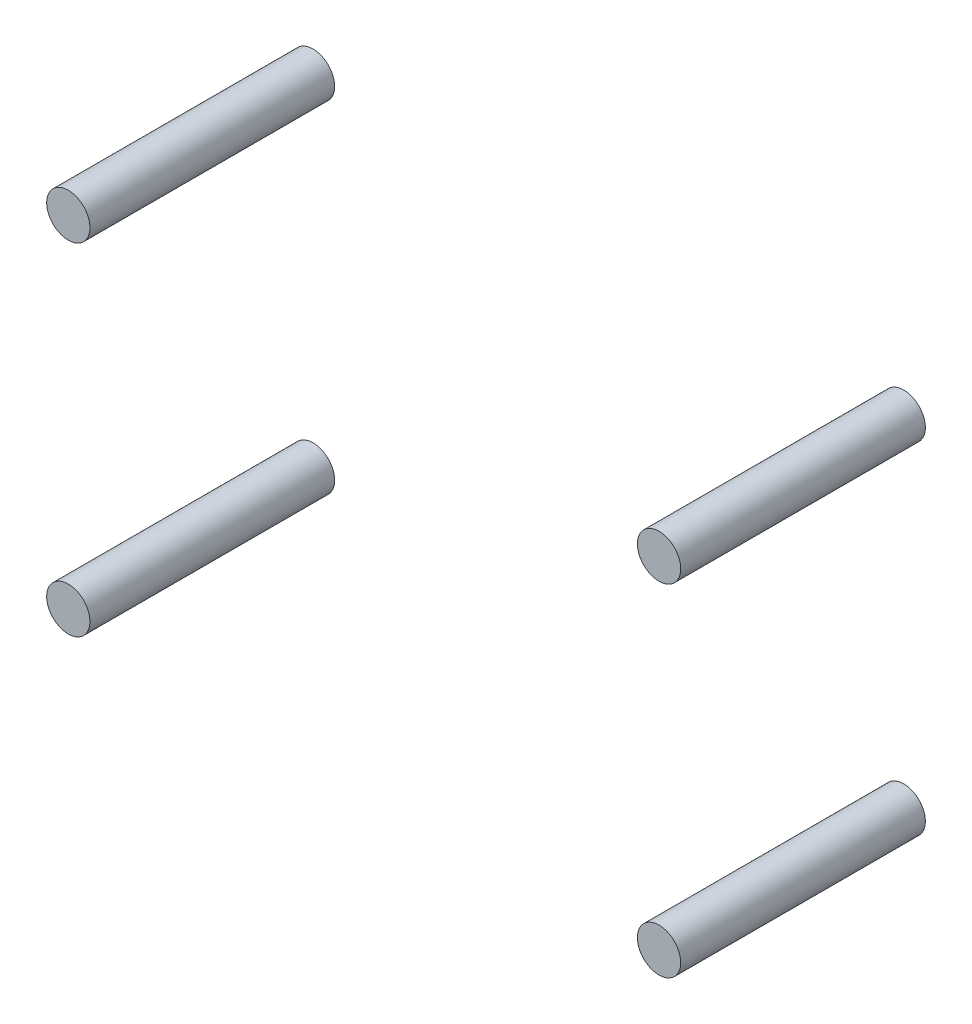
ISO-10303-21;
HEADER;
FILE_DESCRIPTION(('STEP AP214'),'2;1');
FILE_NAME('part.step','',(''),(''),'','','');
FILE_SCHEMA(('AUTOMOTIVE_DESIGN { 1 0 10303 214 1 1 1 1 }'));
ENDSEC;
DATA;
#1=APPLICATION_CONTEXT('core data for automotive mechanical design processes');
#2=APPLICATION_PROTOCOL_DEFINITION('international standard','automotive_design',2000,#1);
#3=PRODUCT_CONTEXT('',#1,'mechanical');
#4=PRODUCT('Part','Part','',(#3));
#5=PRODUCT_RELATED_PRODUCT_CATEGORY('part','',(#4));
#6=PRODUCT_DEFINITION_FORMATION('','',#4);
#7=PRODUCT_DEFINITION_CONTEXT('part definition',#1,'design');
#8=PRODUCT_DEFINITION('design','',#6,#7);
#9=PRODUCT_DEFINITION_SHAPE('','',#8);
#10=(LENGTH_UNIT() NAMED_UNIT(*) SI_UNIT(.MILLI.,.METRE.));
#11=(NAMED_UNIT(*) PLANE_ANGLE_UNIT() SI_UNIT($,.RADIAN.));
#12=(NAMED_UNIT(*) SI_UNIT($,.STERADIAN.) SOLID_ANGLE_UNIT());
#13=UNCERTAINTY_MEASURE_WITH_UNIT(LENGTH_MEASURE(1.E-05),#10,'distance_accuracy_value','');
#14=(GEOMETRIC_REPRESENTATION_CONTEXT(3) GLOBAL_UNCERTAINTY_ASSIGNED_CONTEXT((#13)) GLOBAL_UNIT_ASSIGNED_CONTEXT((#10,
#11,#12)) REPRESENTATION_CONTEXT('',''));
#15=CARTESIAN_POINT('',(0.,0.,0.));
#16=DIRECTION('',(0.,0.,1.));
#17=DIRECTION('',(1.,0.,0.));
#18=AXIS2_PLACEMENT_3D('',#15,#16,#17);
#19=CARTESIAN_POINT('',(15.2256,-9.232966316019,-8.5));
#20=DIRECTION('',(0.,0.,-1.));
#21=DIRECTION('',(-1.,0.,0.));
#22=AXIS2_PLACEMENT_3D('',#19,#20,#21);
#23=PLANE('',#22);
#24=CARTESIAN_POINT('',(13.64,7.875,-8.49999999999964));
#25=DIRECTION('',(0.,0.,-1.));
#26=DIRECTION('',(-1.,0.,0.));
#27=AXIS2_PLACEMENT_3D('',#24,#25,#26);
#28=CIRCLE('',#27,1.);
#29=CARTESIAN_POINT('',(12.64,7.875,-8.49999999999964));
#30=VERTEX_POINT('',#29);
#31=EDGE_CURVE('P0_E19',#30,#30,#28,.T.);
#32=ORIENTED_EDGE('',*,*,#31,.T.);
#33=EDGE_LOOP('',(#32));
#34=FACE_BOUND('',#33,.T.);
#35=ADVANCED_FACE('P0_F15',(#34),#23,.T.);
#36=CARTESIAN_POINT('',(13.64,7.875,2.79999999999999));
#37=DIRECTION('',(0.,0.,-1.));
#38=DIRECTION('',(-1.,0.,0.));
#39=AXIS2_PLACEMENT_3D('',#36,#37,#38);
#40=CYLINDRICAL_SURFACE('',#39,1.);
#41=ORIENTED_EDGE('',*,*,#31,.F.);
#42=EDGE_LOOP('',(#41));
#43=FACE_BOUND('',#42,.T.);
#44=CARTESIAN_POINT('',(13.64,7.875,2.79999999999999));
#45=DIRECTION('',(0.,0.,-1.));
#46=DIRECTION('',(-1.,0.,0.));
#47=AXIS2_PLACEMENT_3D('',#44,#45,#46);
#48=CIRCLE('',#47,1.);
#49=CARTESIAN_POINT('',(12.64,7.875,2.79999999999999));
#50=VERTEX_POINT('',#49);
#51=EDGE_CURVE('P0_E10',#50,#50,#48,.T.);
#52=ORIENTED_EDGE('',*,*,#51,.T.);
#53=EDGE_LOOP('',(#52));
#54=FACE_BOUND('',#53,.T.);
#55=ADVANCED_FACE('P0_F32',(#43,#54),#40,.T.);
#56=CARTESIAN_POINT('',(15.2256,-9.232966316019,2.8));
#57=DIRECTION('',(0.,0.,-1.));
#58=DIRECTION('',(-1.,0.,0.));
#59=AXIS2_PLACEMENT_3D('',#56,#57,#58);
#60=PLANE('',#59);
#61=ORIENTED_EDGE('',*,*,#51,.F.);
#62=EDGE_LOOP('',(#61));
#63=FACE_BOUND('',#62,.T.);
#64=ADVANCED_FACE('P0_F17',(#63),#60,.F.);
#65=CLOSED_SHELL('',(#35,#55,#64));
#66=MANIFOLD_SOLID_BREP('P0_B1',#65);
#67=CARTESIAN_POINT('',(15.2256,-9.232966316019,-8.5));
#68=DIRECTION('',(0.,0.,-1.));
#69=DIRECTION('',(-1.,0.,0.));
#70=AXIS2_PLACEMENT_3D('',#67,#68,#69);
#71=PLANE('',#70);
#72=CARTESIAN_POINT('',(13.64,-7.875,-8.49999999999964));
#73=DIRECTION('',(0.,0.,-1.));
#74=DIRECTION('',(-1.,0.,0.));
#75=AXIS2_PLACEMENT_3D('',#72,#73,#74);
#76=CIRCLE('',#75,1.);
#77=CARTESIAN_POINT('',(12.64,-7.875,-8.49999999999964));
#78=VERTEX_POINT('',#77);
#79=EDGE_CURVE('P1_E19',#78,#78,#76,.T.);
#80=ORIENTED_EDGE('',*,*,#79,.T.);
#81=EDGE_LOOP('',(#80));
#82=FACE_BOUND('',#81,.T.);
#83=ADVANCED_FACE('P1_F15',(#82),#71,.T.);
#84=CARTESIAN_POINT('',(13.64,-7.875,2.79999999999999));
#85=DIRECTION('',(0.,0.,-1.));
#86=DIRECTION('',(-1.,0.,0.));
#87=AXIS2_PLACEMENT_3D('',#84,#85,#86);
#88=CYLINDRICAL_SURFACE('',#87,1.);
#89=ORIENTED_EDGE('',*,*,#79,.F.);
#90=EDGE_LOOP('',(#89));
#91=FACE_BOUND('',#90,.T.);
#92=CARTESIAN_POINT('',(13.64,-7.875,2.79999999999999));
#93=DIRECTION('',(0.,0.,-1.));
#94=DIRECTION('',(-1.,0.,0.));
#95=AXIS2_PLACEMENT_3D('',#92,#93,#94);
#96=CIRCLE('',#95,1.);
#97=CARTESIAN_POINT('',(12.64,-7.875,2.79999999999999));
#98=VERTEX_POINT('',#97);
#99=EDGE_CURVE('P1_E10',#98,#98,#96,.T.);
#100=ORIENTED_EDGE('',*,*,#99,.T.);
#101=EDGE_LOOP('',(#100));
#102=FACE_BOUND('',#101,.T.);
#103=ADVANCED_FACE('P1_F32',(#91,#102),#88,.T.);
#104=CARTESIAN_POINT('',(15.2256,-9.232966316019,2.8));
#105=DIRECTION('',(0.,0.,-1.));
#106=DIRECTION('',(-1.,0.,0.));
#107=AXIS2_PLACEMENT_3D('',#104,#105,#106);
#108=PLANE('',#107);
#109=ORIENTED_EDGE('',*,*,#99,.F.);
#110=EDGE_LOOP('',(#109));
#111=FACE_BOUND('',#110,.T.);
#112=ADVANCED_FACE('P1_F17',(#111),#108,.F.);
#113=CLOSED_SHELL('',(#83,#103,#112));
#114=MANIFOLD_SOLID_BREP('P1_B1',#113);
#115=CARTESIAN_POINT('',(15.2256,-9.232966316019,-8.5));
#116=DIRECTION('',(0.,0.,-1.));
#117=DIRECTION('',(-1.,0.,0.));
#118=AXIS2_PLACEMENT_3D('',#115,#116,#117);
#119=PLANE('',#118);
#120=CARTESIAN_POINT('',(-13.64,7.875,-8.49999999999964));
#121=DIRECTION('',(0.,0.,-1.));
#122=DIRECTION('',(-1.,0.,0.));
#123=AXIS2_PLACEMENT_3D('',#120,#121,#122);
#124=CIRCLE('',#123,0.999999999999999);
#125=CARTESIAN_POINT('',(-14.64,7.875,-8.49999999999964));
#126=VERTEX_POINT('',#125);
#127=EDGE_CURVE('P2_E19',#126,#126,#124,.T.);
#128=ORIENTED_EDGE('',*,*,#127,.T.);
#129=EDGE_LOOP('',(#128));
#130=FACE_BOUND('',#129,.T.);
#131=ADVANCED_FACE('P2_F15',(#130),#119,.T.);
#132=CARTESIAN_POINT('',(-13.64,7.875,2.79999999999999));
#133=DIRECTION('',(0.,0.,-1.));
#134=DIRECTION('',(-1.,0.,0.));
#135=AXIS2_PLACEMENT_3D('',#132,#133,#134);
#136=CYLINDRICAL_SURFACE('',#135,0.999999999999999);
#137=ORIENTED_EDGE('',*,*,#127,.F.);
#138=EDGE_LOOP('',(#137));
#139=FACE_BOUND('',#138,.T.);
#140=CARTESIAN_POINT('',(-13.64,7.875,2.79999999999999));
#141=DIRECTION('',(0.,0.,-1.));
#142=DIRECTION('',(-1.,0.,0.));
#143=AXIS2_PLACEMENT_3D('',#140,#141,#142);
#144=CIRCLE('',#143,0.999999999999999);
#145=CARTESIAN_POINT('',(-14.64,7.875,2.79999999999999));
#146=VERTEX_POINT('',#145);
#147=EDGE_CURVE('P2_E10',#146,#146,#144,.T.);
#148=ORIENTED_EDGE('',*,*,#147,.T.);
#149=EDGE_LOOP('',(#148));
#150=FACE_BOUND('',#149,.T.);
#151=ADVANCED_FACE('P2_F32',(#139,#150),#136,.T.);
#152=CARTESIAN_POINT('',(15.2256,-9.232966316019,2.8));
#153=DIRECTION('',(0.,0.,-1.));
#154=DIRECTION('',(-1.,0.,0.));
#155=AXIS2_PLACEMENT_3D('',#152,#153,#154);
#156=PLANE('',#155);
#157=ORIENTED_EDGE('',*,*,#147,.F.);
#158=EDGE_LOOP('',(#157));
#159=FACE_BOUND('',#158,.T.);
#160=ADVANCED_FACE('P2_F17',(#159),#156,.F.);
#161=CLOSED_SHELL('',(#131,#151,#160));
#162=MANIFOLD_SOLID_BREP('P2_B1',#161);
#163=CARTESIAN_POINT('',(15.2256,-9.232966316019,-8.5));
#164=DIRECTION('',(0.,0.,-1.));
#165=DIRECTION('',(-1.,0.,0.));
#166=AXIS2_PLACEMENT_3D('',#163,#164,#165);
#167=PLANE('',#166);
#168=CARTESIAN_POINT('',(-13.64,-7.875,-8.49999999999964));
#169=DIRECTION('',(0.,0.,-1.));
#170=DIRECTION('',(-1.,0.,0.));
#171=AXIS2_PLACEMENT_3D('',#168,#169,#170);
#172=CIRCLE('',#171,0.999999999999999);
#173=CARTESIAN_POINT('',(-14.64,-7.875,-8.49999999999964));
#174=VERTEX_POINT('',#173);
#175=EDGE_CURVE('P3_E19',#174,#174,#172,.T.);
#176=ORIENTED_EDGE('',*,*,#175,.T.);
#177=EDGE_LOOP('',(#176));
#178=FACE_BOUND('',#177,.T.);
#179=ADVANCED_FACE('P3_F15',(#178),#167,.T.);
#180=CARTESIAN_POINT('',(-13.64,-7.875,2.79999999999999));
#181=DIRECTION('',(0.,0.,-1.));
#182=DIRECTION('',(-1.,0.,0.));
#183=AXIS2_PLACEMENT_3D('',#180,#181,#182);
#184=CYLINDRICAL_SURFACE('',#183,0.999999999999999);
#185=ORIENTED_EDGE('',*,*,#175,.F.);
#186=EDGE_LOOP('',(#185));
#187=FACE_BOUND('',#186,.T.);
#188=CARTESIAN_POINT('',(-13.64,-7.875,2.79999999999999));
#189=DIRECTION('',(0.,0.,-1.));
#190=DIRECTION('',(-1.,0.,0.));
#191=AXIS2_PLACEMENT_3D('',#188,#189,#190);
#192=CIRCLE('',#191,0.999999999999999);
#193=CARTESIAN_POINT('',(-14.64,-7.875,2.79999999999999));
#194=VERTEX_POINT('',#193);
#195=EDGE_CURVE('P3_E10',#194,#194,#192,.T.);
#196=ORIENTED_EDGE('',*,*,#195,.T.);
#197=EDGE_LOOP('',(#196));
#198=FACE_BOUND('',#197,.T.);
#199=ADVANCED_FACE('P3_F32',(#187,#198),#184,.T.);
#200=CARTESIAN_POINT('',(15.2256,-9.232966316019,2.8));
#201=DIRECTION('',(0.,0.,-1.));
#202=DIRECTION('',(-1.,0.,0.));
#203=AXIS2_PLACEMENT_3D('',#200,#201,#202);
#204=PLANE('',#203);
#205=ORIENTED_EDGE('',*,*,#195,.F.);
#206=EDGE_LOOP('',(#205));
#207=FACE_BOUND('',#206,.T.);
#208=ADVANCED_FACE('P3_F17',(#207),#204,.F.);
#209=CLOSED_SHELL('',(#179,#199,#208));
#210=MANIFOLD_SOLID_BREP('P3_B1',#209);
#211=ADVANCED_BREP_SHAPE_REPRESENTATION('',(#18,#66,#114,#162,#210),#14);
#212=SHAPE_DEFINITION_REPRESENTATION(#9,#211);
ENDSEC;
END-ISO-10303-21;
